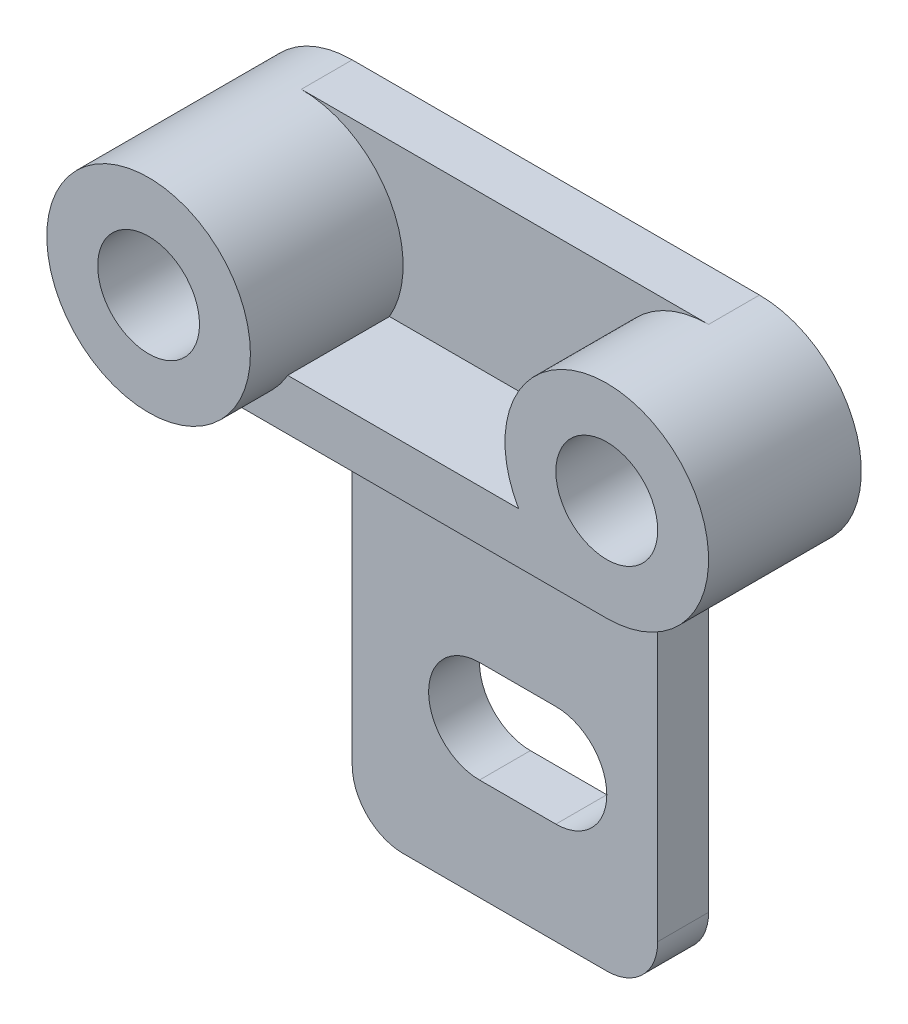
ISO-10303-21;
HEADER;
FILE_DESCRIPTION(('STEP AP214'),'2;1');
FILE_NAME('part.step','',(''),(''),'','','');
FILE_SCHEMA(('AUTOMOTIVE_DESIGN { 1 0 10303 214 1 1 1 1 }'));
ENDSEC;
DATA;
#1=APPLICATION_CONTEXT('core data for automotive mechanical design processes');
#2=APPLICATION_PROTOCOL_DEFINITION('international standard','automotive_design',2000,#1);
#3=PRODUCT_CONTEXT('',#1,'mechanical');
#4=PRODUCT('Part','Part','',(#3));
#5=PRODUCT_RELATED_PRODUCT_CATEGORY('part','',(#4));
#6=PRODUCT_DEFINITION_FORMATION('','',#4);
#7=PRODUCT_DEFINITION_CONTEXT('part definition',#1,'design');
#8=PRODUCT_DEFINITION('design','',#6,#7);
#9=PRODUCT_DEFINITION_SHAPE('','',#8);
#10=(LENGTH_UNIT() NAMED_UNIT(*) SI_UNIT(.MILLI.,.METRE.));
#11=(NAMED_UNIT(*) PLANE_ANGLE_UNIT() SI_UNIT($,.RADIAN.));
#12=(NAMED_UNIT(*) SI_UNIT($,.STERADIAN.) SOLID_ANGLE_UNIT());
#13=UNCERTAINTY_MEASURE_WITH_UNIT(LENGTH_MEASURE(1.E-05),#10,'distance_accuracy_value','');
#14=(GEOMETRIC_REPRESENTATION_CONTEXT(3) GLOBAL_UNCERTAINTY_ASSIGNED_CONTEXT((#13)) GLOBAL_UNIT_ASSIGNED_CONTEXT((#10,
#11,#12)) REPRESENTATION_CONTEXT('',''));
#15=CARTESIAN_POINT('',(0.,0.,0.));
#16=DIRECTION('',(0.,0.,1.));
#17=DIRECTION('',(1.,0.,0.));
#18=AXIS2_PLACEMENT_3D('',#15,#16,#17);
#19=CARTESIAN_POINT('',(30.,0.,10.));
#20=DIRECTION('',(1.,0.,0.));
#21=DIRECTION('',(0.,1.,0.));
#22=AXIS2_PLACEMENT_3D('',#19,#20,#21);
#23=PLANE('',#22);
#24=DIRECTION('',(0.,-1.,0.));
#25=VECTOR('',#24,1.);
#26=CARTESIAN_POINT('',(30.,0.,0.));
#27=LINE('',#26,#25);
#28=CARTESIAN_POINT('',(30.,0.,0.));
#29=VERTEX_POINT('',#28);
#30=CARTESIAN_POINT('',(30.,-69.9999999999999,0.));
#31=VERTEX_POINT('',#30);
#32=EDGE_CURVE('E206',#29,#31,#27,.T.);
#33=ORIENTED_EDGE('',*,*,#32,.T.);
#34=DIRECTION('',(0.,0.,-1.));
#35=VECTOR('',#34,1.);
#36=CARTESIAN_POINT('',(30.,-69.9999999999999,10.));
#37=LINE('',#36,#35);
#38=CARTESIAN_POINT('',(30.,-69.9999999999999,10.));
#39=VERTEX_POINT('',#38);
#40=EDGE_CURVE('E13',#39,#31,#37,.T.);
#41=ORIENTED_EDGE('',*,*,#40,.F.);
#42=DIRECTION('',(0.,-1.,0.));
#43=VECTOR('',#42,1.);
#44=CARTESIAN_POINT('',(30.,0.,10.));
#45=LINE('',#44,#43);
#46=CARTESIAN_POINT('',(30.,0.,10.));
#47=VERTEX_POINT('',#46);
#48=EDGE_CURVE('E263',#47,#39,#45,.T.);
#49=ORIENTED_EDGE('',*,*,#48,.F.);
#50=DIRECTION('',(0.,0.,-1.));
#51=VECTOR('',#50,1.);
#52=CARTESIAN_POINT('',(30.,0.,10.));
#53=LINE('',#52,#51);
#54=EDGE_CURVE('E223',#47,#29,#53,.T.);
#55=ORIENTED_EDGE('',*,*,#54,.T.);
#56=EDGE_LOOP('',(#33,#41,#49,#55));
#57=FACE_BOUND('',#56,.T.);
#58=ADVANCED_FACE('F73',(#57),#23,.F.);
#59=CARTESIAN_POINT('',(40.,-70.,10.));
#60=DIRECTION('',(0.,0.,-1.));
#61=DIRECTION('',(-1.,0.,0.));
#62=AXIS2_PLACEMENT_3D('',#59,#60,#61);
#63=CYLINDRICAL_SURFACE('',#62,9.99999999999999);
#64=CARTESIAN_POINT('',(40.,-70.,0.));
#65=DIRECTION('',(0.,0.,1.));
#66=DIRECTION('',(1.,0.,0.));
#67=AXIS2_PLACEMENT_3D('',#64,#65,#66);
#68=CIRCLE('',#67,9.99999999999999);
#69=CARTESIAN_POINT('',(40.0000000000001,-80.,0.));
#70=VERTEX_POINT('',#69);
#71=EDGE_CURVE('E210',#31,#70,#68,.T.);
#72=ORIENTED_EDGE('',*,*,#71,.T.);
#73=DIRECTION('',(0.,0.,-1.));
#74=VECTOR('',#73,1.);
#75=CARTESIAN_POINT('',(40.0000000000001,-80.,10.));
#76=LINE('',#75,#74);
#77=CARTESIAN_POINT('',(40.0000000000001,-80.,10.));
#78=VERTEX_POINT('',#77);
#79=EDGE_CURVE('E84',#78,#70,#76,.T.);
#80=ORIENTED_EDGE('',*,*,#79,.F.);
#81=CARTESIAN_POINT('',(40.,-70.,10.));
#82=DIRECTION('',(0.,0.,1.));
#83=DIRECTION('',(1.,0.,0.));
#84=AXIS2_PLACEMENT_3D('',#81,#82,#83);
#85=CIRCLE('',#84,9.99999999999999);
#86=EDGE_CURVE('E273',#39,#78,#85,.T.);
#87=ORIENTED_EDGE('',*,*,#86,.F.);
#88=ORIENTED_EDGE('',*,*,#40,.T.);
#89=EDGE_LOOP('',(#72,#80,#87,#88));
#90=FACE_BOUND('',#89,.T.);
#91=ADVANCED_FACE('F280',(#90),#63,.T.);
#92=CARTESIAN_POINT('',(0.,-80.,10.));
#93=DIRECTION('',(0.,1.,0.));
#94=DIRECTION('',(0.,0.,1.));
#95=AXIS2_PLACEMENT_3D('',#92,#93,#94);
#96=PLANE('',#95);
#97=DIRECTION('',(1.,0.,0.));
#98=VECTOR('',#97,1.);
#99=CARTESIAN_POINT('',(0.,-80.,0.));
#100=LINE('',#99,#98);
#101=CARTESIAN_POINT('',(79.9999999999999,-80.,0.));
#102=VERTEX_POINT('',#101);
#103=EDGE_CURVE('E213',#70,#102,#100,.T.);
#104=ORIENTED_EDGE('',*,*,#103,.T.);
#105=DIRECTION('',(0.,0.,-1.));
#106=VECTOR('',#105,1.);
#107=CARTESIAN_POINT('',(79.9999999999999,-80.,10.));
#108=LINE('',#107,#106);
#109=CARTESIAN_POINT('',(79.9999999999999,-80.,10.));
#110=VERTEX_POINT('',#109);
#111=EDGE_CURVE('E179',#110,#102,#108,.T.);
#112=ORIENTED_EDGE('',*,*,#111,.F.);
#113=DIRECTION('',(1.,0.,0.));
#114=VECTOR('',#113,1.);
#115=CARTESIAN_POINT('',(0.,-80.,10.));
#116=LINE('',#115,#114);
#117=EDGE_CURVE('E168',#78,#110,#116,.T.);
#118=ORIENTED_EDGE('',*,*,#117,.F.);
#119=ORIENTED_EDGE('',*,*,#79,.T.);
#120=EDGE_LOOP('',(#104,#112,#118,#119));
#121=FACE_BOUND('',#120,.T.);
#122=ADVANCED_FACE('F283',(#121),#96,.F.);
#123=CARTESIAN_POINT('',(80.,-70.,10.));
#124=DIRECTION('',(0.,0.,-1.));
#125=DIRECTION('',(-1.,0.,0.));
#126=AXIS2_PLACEMENT_3D('',#123,#124,#125);
#127=CYLINDRICAL_SURFACE('',#126,9.99999999999999);
#128=CARTESIAN_POINT('',(80.,-70.,0.));
#129=DIRECTION('',(0.,0.,1.));
#130=DIRECTION('',(1.,0.,0.));
#131=AXIS2_PLACEMENT_3D('',#128,#129,#130);
#132=CIRCLE('',#131,9.99999999999999);
#133=CARTESIAN_POINT('',(90.,-69.9999999999999,0.));
#134=VERTEX_POINT('',#133);
#135=EDGE_CURVE('E177',#102,#134,#132,.T.);
#136=ORIENTED_EDGE('',*,*,#135,.T.);
#137=DIRECTION('',(0.,0.,-1.));
#138=VECTOR('',#137,1.);
#139=CARTESIAN_POINT('',(90.,-69.9999999999999,10.));
#140=LINE('',#139,#138);
#141=CARTESIAN_POINT('',(90.,-69.9999999999999,10.));
#142=VERTEX_POINT('',#141);
#143=EDGE_CURVE('E174',#142,#134,#140,.T.);
#144=ORIENTED_EDGE('',*,*,#143,.F.);
#145=CARTESIAN_POINT('',(80.,-70.,10.));
#146=DIRECTION('',(0.,0.,1.));
#147=DIRECTION('',(1.,0.,0.));
#148=AXIS2_PLACEMENT_3D('',#145,#146,#147);
#149=CIRCLE('',#148,9.99999999999999);
#150=EDGE_CURVE('E162',#110,#142,#149,.T.);
#151=ORIENTED_EDGE('',*,*,#150,.F.);
#152=ORIENTED_EDGE('',*,*,#111,.T.);
#153=EDGE_LOOP('',(#136,#144,#151,#152));
#154=FACE_BOUND('',#153,.T.);
#155=ADVANCED_FACE('F175',(#154),#127,.T.);
#156=CARTESIAN_POINT('',(90.,0.,10.));
#157=DIRECTION('',(-1.,0.,0.));
#158=DIRECTION('',(0.,0.,1.));
#159=AXIS2_PLACEMENT_3D('',#156,#157,#158);
#160=PLANE('',#159);
#161=DIRECTION('',(0.,1.,0.));
#162=VECTOR('',#161,1.);
#163=CARTESIAN_POINT('',(90.,0.,0.));
#164=LINE('',#163,#162);
#165=CARTESIAN_POINT('',(90.,0.,0.));
#166=VERTEX_POINT('',#165);
#167=EDGE_CURVE('E128',#134,#166,#164,.T.);
#168=ORIENTED_EDGE('',*,*,#167,.T.);
#169=DIRECTION('',(0.,0.,-1.));
#170=VECTOR('',#169,1.);
#171=CARTESIAN_POINT('',(90.,0.,10.));
#172=LINE('',#171,#170);
#173=CARTESIAN_POINT('',(90.,0.,10.));
#174=VERTEX_POINT('',#173);
#175=EDGE_CURVE('E180',#174,#166,#172,.T.);
#176=ORIENTED_EDGE('',*,*,#175,.F.);
#177=DIRECTION('',(0.,1.,0.));
#178=VECTOR('',#177,1.);
#179=CARTESIAN_POINT('',(90.,0.,10.));
#180=LINE('',#179,#178);
#181=EDGE_CURVE('E166',#142,#174,#180,.T.);
#182=ORIENTED_EDGE('',*,*,#181,.F.);
#183=ORIENTED_EDGE('',*,*,#143,.T.);
#184=EDGE_LOOP('',(#168,#176,#182,#183));
#185=FACE_BOUND('',#184,.T.);
#186=ADVANCED_FACE('F182',(#185),#160,.F.);
#187=CARTESIAN_POINT('',(70.,-50.,10.));
#188=DIRECTION('',(0.,0.,-1.));
#189=DIRECTION('',(-1.,0.,0.));
#190=AXIS2_PLACEMENT_3D('',#187,#188,#189);
#191=CYLINDRICAL_SURFACE('',#190,10.);
#192=CARTESIAN_POINT('',(70.,-50.,0.));
#193=DIRECTION('',(0.,0.,1.));
#194=DIRECTION('',(1.,0.,0.));
#195=AXIS2_PLACEMENT_3D('',#192,#193,#194);
#196=CIRCLE('',#195,10.);
#197=CARTESIAN_POINT('',(70.,-60.,0.));
#198=VERTEX_POINT('',#197);
#199=CARTESIAN_POINT('',(70.,-40.,0.));
#200=VERTEX_POINT('',#199);
#201=EDGE_CURVE('E190',#198,#200,#196,.T.);
#202=ORIENTED_EDGE('',*,*,#201,.F.);
#203=DIRECTION('',(0.,0.,-1.));
#204=VECTOR('',#203,1.);
#205=CARTESIAN_POINT('',(70.,-60.,10.));
#206=LINE('',#205,#204);
#207=CARTESIAN_POINT('',(70.,-60.,10.));
#208=VERTEX_POINT('',#207);
#209=EDGE_CURVE('E77',#208,#198,#206,.T.);
#210=ORIENTED_EDGE('',*,*,#209,.F.);
#211=CARTESIAN_POINT('',(70.,-50.,10.));
#212=DIRECTION('',(0.,0.,1.));
#213=DIRECTION('',(1.,0.,0.));
#214=AXIS2_PLACEMENT_3D('',#211,#212,#213);
#215=CIRCLE('',#214,10.);
#216=CARTESIAN_POINT('',(70.,-40.,10.));
#217=VERTEX_POINT('',#216);
#218=EDGE_CURVE('E222',#208,#217,#215,.T.);
#219=ORIENTED_EDGE('',*,*,#218,.T.);
#220=DIRECTION('',(0.,0.,-1.));
#221=VECTOR('',#220,1.);
#222=CARTESIAN_POINT('',(70.,-40.,10.));
#223=LINE('',#222,#221);
#224=EDGE_CURVE('E186',#217,#200,#223,.T.);
#225=ORIENTED_EDGE('',*,*,#224,.T.);
#226=EDGE_LOOP('',(#202,#210,#219,#225));
#227=FACE_BOUND('',#226,.T.);
#228=ADVANCED_FACE('F75',(#227),#191,.F.);
#229=CARTESIAN_POINT('',(0.,-60.,10.));
#230=DIRECTION('',(0.,1.,0.));
#231=DIRECTION('',(0.,0.,1.));
#232=AXIS2_PLACEMENT_3D('',#229,#230,#231);
#233=PLANE('',#232);
#234=DIRECTION('',(1.,0.,0.));
#235=VECTOR('',#234,1.);
#236=CARTESIAN_POINT('',(0.,-60.,0.));
#237=LINE('',#236,#235);
#238=CARTESIAN_POINT('',(55.,-60.,0.));
#239=VERTEX_POINT('',#238);
#240=EDGE_CURVE('E194',#239,#198,#237,.T.);
#241=ORIENTED_EDGE('',*,*,#240,.F.);
#242=DIRECTION('',(0.,0.,-1.));
#243=VECTOR('',#242,1.);
#244=CARTESIAN_POINT('',(55.,-60.,10.));
#245=LINE('',#244,#243);
#246=CARTESIAN_POINT('',(55.,-60.,10.));
#247=VERTEX_POINT('',#246);
#248=EDGE_CURVE('E237',#247,#239,#245,.T.);
#249=ORIENTED_EDGE('',*,*,#248,.F.);
#250=DIRECTION('',(1.,0.,0.));
#251=VECTOR('',#250,1.);
#252=CARTESIAN_POINT('',(0.,-60.,10.));
#253=LINE('',#252,#251);
#254=EDGE_CURVE('E248',#247,#208,#253,.T.);
#255=ORIENTED_EDGE('',*,*,#254,.T.);
#256=ORIENTED_EDGE('',*,*,#209,.T.);
#257=EDGE_LOOP('',(#241,#249,#255,#256));
#258=FACE_BOUND('',#257,.T.);
#259=ADVANCED_FACE('F246',(#258),#233,.T.);
#260=CARTESIAN_POINT('',(55.,-50.,10.));
#261=DIRECTION('',(0.,0.,-1.));
#262=DIRECTION('',(-1.,0.,0.));
#263=AXIS2_PLACEMENT_3D('',#260,#261,#262);
#264=CYLINDRICAL_SURFACE('',#263,10.);
#265=CARTESIAN_POINT('',(55.,-50.,0.));
#266=DIRECTION('',(0.,0.,1.));
#267=DIRECTION('',(1.,0.,0.));
#268=AXIS2_PLACEMENT_3D('',#265,#266,#267);
#269=CIRCLE('',#268,10.);
#270=CARTESIAN_POINT('',(55.,-40.,0.));
#271=VERTEX_POINT('',#270);
#272=EDGE_CURVE('E198',#271,#239,#269,.T.);
#273=ORIENTED_EDGE('',*,*,#272,.F.);
#274=DIRECTION('',(0.,0.,-1.));
#275=VECTOR('',#274,1.);
#276=CARTESIAN_POINT('',(55.,-40.,10.));
#277=LINE('',#276,#275);
#278=CARTESIAN_POINT('',(55.,-40.,10.));
#279=VERTEX_POINT('',#278);
#280=EDGE_CURVE('E235',#279,#271,#277,.T.);
#281=ORIENTED_EDGE('',*,*,#280,.F.);
#282=CARTESIAN_POINT('',(55.,-50.,10.));
#283=DIRECTION('',(0.,0.,1.));
#284=DIRECTION('',(1.,0.,0.));
#285=AXIS2_PLACEMENT_3D('',#282,#283,#284);
#286=CIRCLE('',#285,10.);
#287=EDGE_CURVE('E257',#279,#247,#286,.T.);
#288=ORIENTED_EDGE('',*,*,#287,.T.);
#289=ORIENTED_EDGE('',*,*,#248,.T.);
#290=EDGE_LOOP('',(#273,#281,#288,#289));
#291=FACE_BOUND('',#290,.T.);
#292=ADVANCED_FACE('F254',(#291),#264,.F.);
#293=CARTESIAN_POINT('',(0.,-40.,10.));
#294=DIRECTION('',(0.,1.,0.));
#295=DIRECTION('',(0.,0.,1.));
#296=AXIS2_PLACEMENT_3D('',#293,#294,#295);
#297=PLANE('',#296);
#298=DIRECTION('',(1.,0.,0.));
#299=VECTOR('',#298,1.);
#300=CARTESIAN_POINT('',(0.,-40.,0.));
#301=LINE('',#300,#299);
#302=EDGE_CURVE('E202',#271,#200,#301,.T.);
#303=ORIENTED_EDGE('',*,*,#302,.T.);
#304=ORIENTED_EDGE('',*,*,#224,.F.);
#305=DIRECTION('',(1.,0.,0.));
#306=VECTOR('',#305,1.);
#307=CARTESIAN_POINT('',(0.,-40.,10.));
#308=LINE('',#307,#306);
#309=EDGE_CURVE('E259',#279,#217,#308,.T.);
#310=ORIENTED_EDGE('',*,*,#309,.F.);
#311=ORIENTED_EDGE('',*,*,#280,.T.);
#312=EDGE_LOOP('',(#303,#304,#310,#311));
#313=FACE_BOUND('',#312,.T.);
#314=ADVANCED_FACE('F260',(#313),#297,.F.);
#315=CARTESIAN_POINT('',(0.,0.,10.));
#316=DIRECTION('',(0.,-1.,0.));
#317=DIRECTION('',(1.,0.,0.));
#318=AXIS2_PLACEMENT_3D('',#315,#316,#317);
#319=PLANE('',#318);
#320=DIRECTION('',(-1.,0.,0.));
#321=VECTOR('',#320,1.);
#322=CARTESIAN_POINT('',(0.,0.,0.));
#323=LINE('',#322,#321);
#324=EDGE_CURVE('E134',#166,#29,#323,.T.);
#325=ORIENTED_EDGE('',*,*,#324,.T.);
#326=ORIENTED_EDGE('',*,*,#54,.F.);
#327=DIRECTION('',(-1.,0.,0.));
#328=VECTOR('',#327,1.);
#329=CARTESIAN_POINT('',(0.,0.,10.));
#330=LINE('',#329,#328);
#331=EDGE_CURVE('E93',#174,#47,#330,.T.);
#332=ORIENTED_EDGE('',*,*,#331,.F.);
#333=ORIENTED_EDGE('',*,*,#175,.T.);
#334=EDGE_LOOP('',(#325,#326,#332,#333));
#335=FACE_BOUND('',#334,.T.);
#336=ADVANCED_FACE('F286',(#335),#319,.F.);
#337=CARTESIAN_POINT('',(0.,0.,10.));
#338=DIRECTION('',(0.,0.,1.));
#339=DIRECTION('',(1.,0.,0.));
#340=AXIS2_PLACEMENT_3D('',#337,#338,#339);
#341=PLANE('',#340);
#342=ORIENTED_EDGE('',*,*,#218,.F.);
#343=ORIENTED_EDGE('',*,*,#254,.F.);
#344=ORIENTED_EDGE('',*,*,#287,.F.);
#345=ORIENTED_EDGE('',*,*,#309,.T.);
#346=EDGE_LOOP('',(#342,#343,#344,#345));
#347=FACE_BOUND('',#346,.T.);
#348=ORIENTED_EDGE('',*,*,#48,.T.);
#349=ORIENTED_EDGE('',*,*,#86,.T.);
#350=ORIENTED_EDGE('',*,*,#117,.T.);
#351=ORIENTED_EDGE('',*,*,#150,.T.);
#352=ORIENTED_EDGE('',*,*,#181,.T.);
#353=ORIENTED_EDGE('',*,*,#331,.T.);
#354=EDGE_LOOP('',(#348,#349,#350,#351,#352,#353));
#355=FACE_BOUND('',#354,.T.);
#356=ADVANCED_FACE('F164',(#347,#355),#341,.T.);
#357=CARTESIAN_POINT('',(0.,0.,0.));
#358=DIRECTION('',(0.,0.,1.));
#359=DIRECTION('',(1.,0.,0.));
#360=AXIS2_PLACEMENT_3D('',#357,#358,#359);
#361=PLANE('',#360);
#362=ORIENTED_EDGE('',*,*,#201,.T.);
#363=ORIENTED_EDGE('',*,*,#302,.F.);
#364=ORIENTED_EDGE('',*,*,#272,.T.);
#365=ORIENTED_EDGE('',*,*,#240,.T.);
#366=EDGE_LOOP('',(#362,#363,#364,#365));
#367=FACE_BOUND('',#366,.T.);
#368=ORIENTED_EDGE('',*,*,#32,.F.);
#369=ORIENTED_EDGE('',*,*,#324,.F.);
#370=ORIENTED_EDGE('',*,*,#167,.F.);
#371=ORIENTED_EDGE('',*,*,#135,.F.);
#372=ORIENTED_EDGE('',*,*,#103,.F.);
#373=ORIENTED_EDGE('',*,*,#71,.F.);
#374=EDGE_LOOP('',(#368,#369,#370,#371,#372,#373));
#375=FACE_BOUND('',#374,.T.);
#376=ADVANCED_FACE('F252',(#367,#375),#361,.F.);
#377=CLOSED_SHELL('',(#58,#91,#122,#155,#186,#228,#259,#292,#314,#336,#356,#376));
#378=MANIFOLD_SOLID_BREP('B2',#377);
#379=CARTESIAN_POINT('',(100.,20.,30.));
#380=DIRECTION('',(0.,0.,-1.));
#381=DIRECTION('',(-1.,0.,0.));
#382=AXIS2_PLACEMENT_3D('',#379,#380,#381);
#383=CYLINDRICAL_SURFACE('',#382,20.);
#384=CARTESIAN_POINT('',(100.,20.,0.));
#385=DIRECTION('',(0.,0.,1.));
#386=DIRECTION('',(1.,0.,0.));
#387=AXIS2_PLACEMENT_3D('',#384,#385,#386);
#388=CIRCLE('',#387,20.);
#389=CARTESIAN_POINT('',(82.6794919243113,9.99999999999999,0.));
#390=VERTEX_POINT('',#389);
#391=CARTESIAN_POINT('',(100.,0.,0.));
#392=VERTEX_POINT('',#391);
#393=EDGE_CURVE('E481',#390,#392,#388,.F.);
#394=ORIENTED_EDGE('',*,*,#393,.F.);
#395=DIRECTION('',(0.,0.,-1.));
#396=VECTOR('',#395,1.);
#397=CARTESIAN_POINT('',(82.6794919243113,9.99999999999999,30.));
#398=LINE('',#397,#396);
#399=CARTESIAN_POINT('',(82.6794919243113,9.99999999999999,30.));
#400=VERTEX_POINT('',#399);
#401=EDGE_CURVE('E71',#400,#390,#398,.T.);
#402=ORIENTED_EDGE('',*,*,#401,.F.);
#403=CARTESIAN_POINT('',(100.,20.,30.));
#404=DIRECTION('',(0.,0.,1.));
#405=DIRECTION('',(1.,0.,0.));
#406=AXIS2_PLACEMENT_3D('',#403,#404,#405);
#407=CIRCLE('',#406,20.);
#408=CARTESIAN_POINT('',(100.,0.,30.));
#409=VERTEX_POINT('',#408);
#410=EDGE_CURVE('E466',#400,#409,#407,.F.);
#411=ORIENTED_EDGE('',*,*,#410,.T.);
#412=DIRECTION('',(0.,0.,-1.));
#413=VECTOR('',#412,1.);
#414=CARTESIAN_POINT('',(100.,0.,30.));
#415=LINE('',#414,#413);
#416=EDGE_CURVE('E434',#409,#392,#415,.T.);
#417=ORIENTED_EDGE('',*,*,#416,.T.);
#418=EDGE_LOOP('',(#394,#402,#411,#417));
#419=FACE_BOUND('',#418,.T.);
#420=ADVANCED_FACE('F418',(#419),#383,.T.);
#421=CARTESIAN_POINT('',(0.,9.99999999999999,30.));
#422=DIRECTION('',(0.,-1.,0.));
#423=DIRECTION('',(0.,0.,-1.));
#424=AXIS2_PLACEMENT_3D('',#421,#422,#423);
#425=PLANE('',#424);
#426=DIRECTION('',(-1.,0.,0.));
#427=VECTOR('',#426,1.);
#428=CARTESIAN_POINT('',(0.,9.99999999999999,0.));
#429=LINE('',#428,#427);
#430=CARTESIAN_POINT('',(37.3205080756888,9.99999999999999,0.));
#431=VERTEX_POINT('',#430);
#432=EDGE_CURVE('E472',#390,#431,#429,.T.);
#433=ORIENTED_EDGE('',*,*,#432,.T.);
#434=DIRECTION('',(0.,0.,-1.));
#435=VECTOR('',#434,1.);
#436=CARTESIAN_POINT('',(37.3205080756888,9.99999999999999,30.));
#437=LINE('',#436,#435);
#438=CARTESIAN_POINT('',(37.3205080756888,9.99999999999999,30.));
#439=VERTEX_POINT('',#438);
#440=EDGE_CURVE('E426',#439,#431,#437,.T.);
#441=ORIENTED_EDGE('',*,*,#440,.F.);
#442=DIRECTION('',(-1.,0.,0.));
#443=VECTOR('',#442,1.);
#444=CARTESIAN_POINT('',(0.,9.99999999999999,30.));
#445=LINE('',#444,#443);
#446=EDGE_CURVE('E460',#400,#439,#445,.T.);
#447=ORIENTED_EDGE('',*,*,#446,.F.);
#448=ORIENTED_EDGE('',*,*,#401,.T.);
#449=EDGE_LOOP('',(#433,#441,#447,#448));
#450=FACE_BOUND('',#449,.T.);
#451=ADVANCED_FACE('F470',(#450),#425,.F.);
#452=CARTESIAN_POINT('',(20.,20.,30.));
#453=DIRECTION('',(0.,0.,-1.));
#454=DIRECTION('',(-1.,0.,0.));
#455=AXIS2_PLACEMENT_3D('',#452,#453,#454);
#456=CYLINDRICAL_SURFACE('',#455,20.);
#457=CARTESIAN_POINT('',(20.,20.,0.));
#458=DIRECTION('',(0.,0.,1.));
#459=DIRECTION('',(1.,0.,0.));
#460=AXIS2_PLACEMENT_3D('',#457,#458,#459);
#461=CIRCLE('',#460,20.);
#462=CARTESIAN_POINT('',(20.,0.,0.));
#463=VERTEX_POINT('',#462);
#464=EDGE_CURVE('E485',#463,#431,#461,.T.);
#465=ORIENTED_EDGE('',*,*,#464,.F.);
#466=DIRECTION('',(0.,0.,-1.));
#467=VECTOR('',#466,1.);
#468=CARTESIAN_POINT('',(20.,0.,30.));
#469=LINE('',#468,#467);
#470=CARTESIAN_POINT('',(20.,0.,30.));
#471=VERTEX_POINT('',#470);
#472=EDGE_CURVE('E447',#471,#463,#469,.T.);
#473=ORIENTED_EDGE('',*,*,#472,.F.);
#474=CARTESIAN_POINT('',(20.,20.,30.));
#475=DIRECTION('',(0.,0.,1.));
#476=DIRECTION('',(1.,0.,0.));
#477=AXIS2_PLACEMENT_3D('',#474,#475,#476);
#478=CIRCLE('',#477,20.);
#479=EDGE_CURVE('E465',#471,#439,#478,.T.);
#480=ORIENTED_EDGE('',*,*,#479,.T.);
#481=ORIENTED_EDGE('',*,*,#440,.T.);
#482=EDGE_LOOP('',(#465,#473,#480,#481));
#483=FACE_BOUND('',#482,.T.);
#484=ADVANCED_FACE('F475',(#483),#456,.F.);
#485=CARTESIAN_POINT('',(0.,0.,30.));
#486=DIRECTION('',(0.,-1.,0.));
#487=DIRECTION('',(1.,0.,0.));
#488=AXIS2_PLACEMENT_3D('',#485,#486,#487);
#489=PLANE('',#488);
#490=DIRECTION('',(-1.,0.,0.));
#491=VECTOR('',#490,1.);
#492=CARTESIAN_POINT('',(0.,0.,0.));
#493=LINE('',#492,#491);
#494=EDGE_CURVE('E487',#392,#463,#493,.T.);
#495=ORIENTED_EDGE('',*,*,#494,.F.);
#496=ORIENTED_EDGE('',*,*,#416,.F.);
#497=DIRECTION('',(-1.,0.,0.));
#498=VECTOR('',#497,1.);
#499=CARTESIAN_POINT('',(0.,0.,30.));
#500=LINE('',#499,#498);
#501=EDGE_CURVE('E476',#409,#471,#500,.T.);
#502=ORIENTED_EDGE('',*,*,#501,.T.);
#503=ORIENTED_EDGE('',*,*,#472,.T.);
#504=EDGE_LOOP('',(#495,#496,#502,#503));
#505=FACE_BOUND('',#504,.T.);
#506=ADVANCED_FACE('F504',(#505),#489,.T.);
#507=CARTESIAN_POINT('',(0.,0.,30.));
#508=DIRECTION('',(0.,0.,1.));
#509=DIRECTION('',(1.,0.,0.));
#510=AXIS2_PLACEMENT_3D('',#507,#508,#509);
#511=PLANE('',#510);
#512=CARTESIAN_POINT('',(100.,20.,30.));
#513=DIRECTION('',(0.,0.,1.));
#514=DIRECTION('',(1.,0.,0.));
#515=AXIS2_PLACEMENT_3D('',#512,#513,#514);
#516=CIRCLE('',#515,9.99999999999999);
#517=CARTESIAN_POINT('',(110.,20.,30.));
#518=VERTEX_POINT('',#517);
#519=EDGE_CURVE('E483',#518,#518,#516,.T.);
#520=ORIENTED_EDGE('',*,*,#519,.F.);
#521=EDGE_LOOP('',(#520));
#522=FACE_BOUND('',#521,.T.);
#523=ORIENTED_EDGE('',*,*,#410,.F.);
#524=ORIENTED_EDGE('',*,*,#446,.T.);
#525=ORIENTED_EDGE('',*,*,#479,.F.);
#526=ORIENTED_EDGE('',*,*,#501,.F.);
#527=EDGE_LOOP('',(#523,#524,#525,#526));
#528=FACE_BOUND('',#527,.T.);
#529=ADVANCED_FACE('F462',(#522,#528),#511,.T.);
#530=CARTESIAN_POINT('',(0.,0.,0.));
#531=DIRECTION('',(0.,0.,1.));
#532=DIRECTION('',(1.,0.,0.));
#533=AXIS2_PLACEMENT_3D('',#530,#531,#532);
#534=PLANE('',#533);
#535=CARTESIAN_POINT('',(100.,20.,0.));
#536=DIRECTION('',(0.,0.,-1.));
#537=DIRECTION('',(-1.,0.,0.));
#538=AXIS2_PLACEMENT_3D('',#535,#536,#537);
#539=CIRCLE('',#538,9.99999999999999);
#540=CARTESIAN_POINT('',(90.,20.,0.));
#541=VERTEX_POINT('',#540);
#542=EDGE_CURVE('E495',#541,#541,#539,.T.);
#543=ORIENTED_EDGE('',*,*,#542,.F.);
#544=EDGE_LOOP('',(#543));
#545=FACE_BOUND('',#544,.T.);
#546=ORIENTED_EDGE('',*,*,#393,.T.);
#547=ORIENTED_EDGE('',*,*,#494,.T.);
#548=ORIENTED_EDGE('',*,*,#464,.T.);
#549=ORIENTED_EDGE('',*,*,#432,.F.);
#550=EDGE_LOOP('',(#546,#547,#548,#549));
#551=FACE_BOUND('',#550,.T.);
#552=ADVANCED_FACE('F501',(#545,#551),#534,.F.);
#553=CARTESIAN_POINT('',(100.,20.,40.));
#554=DIRECTION('',(0.,0.,-1.));
#555=DIRECTION('',(-1.,0.,0.));
#556=AXIS2_PLACEMENT_3D('',#553,#554,#555);
#557=CYLINDRICAL_SURFACE('',#556,9.99999999999999);
#558=ORIENTED_EDGE('',*,*,#519,.T.);
#559=EDGE_LOOP('',(#558));
#560=FACE_BOUND('',#559,.T.);
#561=ORIENTED_EDGE('',*,*,#542,.T.);
#562=EDGE_LOOP('',(#561));
#563=FACE_BOUND('',#562,.T.);
#564=ADVANCED_FACE('F499',(#560,#563),#557,.F.);
#565=CLOSED_SHELL('',(#420,#451,#484,#506,#529,#552,#564));
#566=MANIFOLD_SOLID_BREP('B7',#565);
#567=CARTESIAN_POINT('',(100.,20.,10.));
#568=DIRECTION('',(0.,0.,-1.));
#569=DIRECTION('',(-1.,0.,0.));
#570=AXIS2_PLACEMENT_3D('',#567,#568,#569);
#571=CYLINDRICAL_SURFACE('',#570,20.);
#572=CARTESIAN_POINT('',(100.,20.,0.));
#573=DIRECTION('',(0.,0.,1.));
#574=DIRECTION('',(1.,0.,0.));
#575=AXIS2_PLACEMENT_3D('',#572,#573,#574);
#576=CIRCLE('',#575,20.);
#577=CARTESIAN_POINT('',(100.,40.,0.));
#578=VERTEX_POINT('',#577);
#579=CARTESIAN_POINT('',(100.,0.,0.));
#580=VERTEX_POINT('',#579);
#581=EDGE_CURVE('E632',#578,#580,#576,.F.);
#582=ORIENTED_EDGE('',*,*,#581,.F.);
#583=DIRECTION('',(0.,0.,-1.));
#584=VECTOR('',#583,1.);
#585=CARTESIAN_POINT('',(100.,40.,10.));
#586=LINE('',#585,#584);
#587=CARTESIAN_POINT('',(100.,40.,10.));
#588=VERTEX_POINT('',#587);
#589=EDGE_CURVE('E416',#588,#578,#586,.T.);
#590=ORIENTED_EDGE('',*,*,#589,.F.);
#591=CARTESIAN_POINT('',(100.,20.,10.));
#592=DIRECTION('',(0.,0.,1.));
#593=DIRECTION('',(1.,0.,0.));
#594=AXIS2_PLACEMENT_3D('',#591,#592,#593);
#595=CIRCLE('',#594,20.);
#596=CARTESIAN_POINT('',(100.,0.,10.));
#597=VERTEX_POINT('',#596);
#598=EDGE_CURVE('E644',#588,#597,#595,.F.);
#599=ORIENTED_EDGE('',*,*,#598,.T.);
#600=DIRECTION('',(0.,0.,-1.));
#601=VECTOR('',#600,1.);
#602=CARTESIAN_POINT('',(100.,0.,10.));
#603=LINE('',#602,#601);
#604=EDGE_CURVE('E599',#597,#580,#603,.T.);
#605=ORIENTED_EDGE('',*,*,#604,.T.);
#606=EDGE_LOOP('',(#582,#590,#599,#605));
#607=FACE_BOUND('',#606,.T.);
#608=ADVANCED_FACE('F583',(#607),#571,.T.);
#609=CARTESIAN_POINT('',(0.,40.,10.));
#610=DIRECTION('',(0.,1.,0.));
#611=DIRECTION('',(0.,0.,1.));
#612=AXIS2_PLACEMENT_3D('',#609,#610,#611);
#613=PLANE('',#612);
#614=DIRECTION('',(1.,0.,0.));
#615=VECTOR('',#614,1.);
#616=CARTESIAN_POINT('',(0.,40.,0.));
#617=LINE('',#616,#615);
#618=CARTESIAN_POINT('',(20.,40.,0.));
#619=VERTEX_POINT('',#618);
#620=EDGE_CURVE('E641',#619,#578,#617,.T.);
#621=ORIENTED_EDGE('',*,*,#620,.F.);
#622=DIRECTION('',(0.,0.,-1.));
#623=VECTOR('',#622,1.);
#624=CARTESIAN_POINT('',(20.,40.,10.));
#625=LINE('',#624,#623);
#626=CARTESIAN_POINT('',(20.,40.,10.));
#627=VERTEX_POINT('',#626);
#628=EDGE_CURVE('E591',#627,#619,#625,.T.);
#629=ORIENTED_EDGE('',*,*,#628,.F.);
#630=DIRECTION('',(1.,0.,0.));
#631=VECTOR('',#630,1.);
#632=CARTESIAN_POINT('',(0.,40.,10.));
#633=LINE('',#632,#631);
#634=EDGE_CURVE('E639',#627,#588,#633,.T.);
#635=ORIENTED_EDGE('',*,*,#634,.T.);
#636=ORIENTED_EDGE('',*,*,#589,.T.);
#637=EDGE_LOOP('',(#621,#629,#635,#636));
#638=FACE_BOUND('',#637,.T.);
#639=ADVANCED_FACE('F638',(#638),#613,.T.);
#640=CARTESIAN_POINT('',(20.,20.,10.));
#641=DIRECTION('',(0.,0.,-1.));
#642=DIRECTION('',(-1.,0.,0.));
#643=AXIS2_PLACEMENT_3D('',#640,#641,#642);
#644=CYLINDRICAL_SURFACE('',#643,20.);
#645=CARTESIAN_POINT('',(20.,20.,0.));
#646=DIRECTION('',(0.,0.,1.));
#647=DIRECTION('',(1.,0.,0.));
#648=AXIS2_PLACEMENT_3D('',#645,#646,#647);
#649=CIRCLE('',#648,20.);
#650=CARTESIAN_POINT('',(20.,0.,0.));
#651=VERTEX_POINT('',#650);
#652=EDGE_CURVE('E656',#619,#651,#649,.T.);
#653=ORIENTED_EDGE('',*,*,#652,.T.);
#654=DIRECTION('',(0.,0.,-1.));
#655=VECTOR('',#654,1.);
#656=CARTESIAN_POINT('',(20.,0.,10.));
#657=LINE('',#656,#655);
#658=CARTESIAN_POINT('',(20.,0.,10.));
#659=VERTEX_POINT('',#658);
#660=EDGE_CURVE('E614',#659,#651,#657,.T.);
#661=ORIENTED_EDGE('',*,*,#660,.F.);
#662=CARTESIAN_POINT('',(20.,20.,10.));
#663=DIRECTION('',(0.,0.,1.));
#664=DIRECTION('',(1.,0.,0.));
#665=AXIS2_PLACEMENT_3D('',#662,#663,#664);
#666=CIRCLE('',#665,20.);
#667=EDGE_CURVE('E624',#627,#659,#666,.F.);
#668=ORIENTED_EDGE('',*,*,#667,.F.);
#669=ORIENTED_EDGE('',*,*,#628,.T.);
#670=EDGE_LOOP('',(#653,#661,#668,#669));
#671=FACE_BOUND('',#670,.T.);
#672=CARTESIAN_POINT('',(20.,20.,40.));
#673=DIRECTION('',(0.,0.,1.));
#674=DIRECTION('',(1.,0.,0.));
#675=AXIS2_PLACEMENT_3D('',#672,#673,#674);
#676=CIRCLE('',#675,20.);
#677=CARTESIAN_POINT('',(40.,20.,40.));
#678=VERTEX_POINT('',#677);
#679=EDGE_CURVE('E633',#678,#678,#676,.T.);
#680=ORIENTED_EDGE('',*,*,#679,.F.);
#681=EDGE_LOOP('',(#680));
#682=FACE_BOUND('',#681,.T.);
#683=ADVANCED_FACE('F626',(#671,#682),#644,.T.);
#684=CARTESIAN_POINT('',(0.,0.,10.));
#685=DIRECTION('',(0.,-1.,0.));
#686=DIRECTION('',(1.,0.,0.));
#687=AXIS2_PLACEMENT_3D('',#684,#685,#686);
#688=PLANE('',#687);
#689=DIRECTION('',(-1.,0.,0.));
#690=VECTOR('',#689,1.);
#691=CARTESIAN_POINT('',(0.,0.,0.));
#692=LINE('',#691,#690);
#693=EDGE_CURVE('E658',#580,#651,#692,.T.);
#694=ORIENTED_EDGE('',*,*,#693,.F.);
#695=ORIENTED_EDGE('',*,*,#604,.F.);
#696=DIRECTION('',(-1.,0.,0.));
#697=VECTOR('',#696,1.);
#698=CARTESIAN_POINT('',(0.,0.,10.));
#699=LINE('',#698,#697);
#700=EDGE_CURVE('E645',#597,#659,#699,.T.);
#701=ORIENTED_EDGE('',*,*,#700,.T.);
#702=ORIENTED_EDGE('',*,*,#660,.T.);
#703=EDGE_LOOP('',(#694,#695,#701,#702));
#704=FACE_BOUND('',#703,.T.);
#705=ADVANCED_FACE('F688',(#704),#688,.T.);
#706=CARTESIAN_POINT('',(100.,20.,10.));
#707=DIRECTION('',(0.,0.,-1.));
#708=DIRECTION('',(-1.,0.,0.));
#709=AXIS2_PLACEMENT_3D('',#706,#707,#708);
#710=CYLINDRICAL_SURFACE('',#709,9.99999999999999);
#711=CARTESIAN_POINT('',(100.,20.,10.));
#712=DIRECTION('',(0.,0.,1.));
#713=DIRECTION('',(1.,0.,0.));
#714=AXIS2_PLACEMENT_3D('',#711,#712,#713);
#715=CIRCLE('',#714,9.99999999999999);
#716=CARTESIAN_POINT('',(110.,20.,10.));
#717=VERTEX_POINT('',#716);
#718=EDGE_CURVE('E647',#717,#717,#715,.F.);
#719=ORIENTED_EDGE('',*,*,#718,.F.);
#720=EDGE_LOOP('',(#719));
#721=FACE_BOUND('',#720,.T.);
#722=CARTESIAN_POINT('',(100.,20.,0.));
#723=DIRECTION('',(0.,0.,1.));
#724=DIRECTION('',(1.,0.,0.));
#725=AXIS2_PLACEMENT_3D('',#722,#723,#724);
#726=CIRCLE('',#725,9.99999999999999);
#727=CARTESIAN_POINT('',(110.,20.,0.));
#728=VERTEX_POINT('',#727);
#729=EDGE_CURVE('E649',#728,#728,#726,.F.);
#730=ORIENTED_EDGE('',*,*,#729,.T.);
#731=EDGE_LOOP('',(#730));
#732=FACE_BOUND('',#731,.T.);
#733=ADVANCED_FACE('F666',(#721,#732),#710,.F.);
#734=CARTESIAN_POINT('',(0.,0.,10.));
#735=DIRECTION('',(0.,0.,1.));
#736=DIRECTION('',(1.,0.,0.));
#737=AXIS2_PLACEMENT_3D('',#734,#735,#736);
#738=PLANE('',#737);
#739=ORIENTED_EDGE('',*,*,#634,.F.);
#740=ORIENTED_EDGE('',*,*,#667,.T.);
#741=ORIENTED_EDGE('',*,*,#700,.F.);
#742=ORIENTED_EDGE('',*,*,#598,.F.);
#743=EDGE_LOOP('',(#739,#740,#741,#742));
#744=FACE_BOUND('',#743,.T.);
#745=ORIENTED_EDGE('',*,*,#718,.T.);
#746=EDGE_LOOP('',(#745));
#747=FACE_BOUND('',#746,.T.);
#748=ADVANCED_FACE('F642',(#744,#747),#738,.T.);
#749=CARTESIAN_POINT('',(0.,0.,0.));
#750=DIRECTION('',(0.,0.,1.));
#751=DIRECTION('',(1.,0.,0.));
#752=AXIS2_PLACEMENT_3D('',#749,#750,#751);
#753=PLANE('',#752);
#754=CARTESIAN_POINT('',(20.,20.,0.));
#755=DIRECTION('',(0.,0.,1.));
#756=DIRECTION('',(1.,0.,0.));
#757=AXIS2_PLACEMENT_3D('',#754,#755,#756);
#758=CIRCLE('',#757,10.);
#759=CARTESIAN_POINT('',(30.,20.,0.));
#760=VERTEX_POINT('',#759);
#761=EDGE_CURVE('E789',#760,#760,#758,.T.);
#762=ORIENTED_EDGE('',*,*,#761,.T.);
#763=EDGE_LOOP('',(#762));
#764=FACE_BOUND('',#763,.T.);
#765=ORIENTED_EDGE('',*,*,#693,.T.);
#766=ORIENTED_EDGE('',*,*,#652,.F.);
#767=ORIENTED_EDGE('',*,*,#620,.T.);
#768=ORIENTED_EDGE('',*,*,#581,.T.);
#769=EDGE_LOOP('',(#765,#766,#767,#768));
#770=FACE_BOUND('',#769,.T.);
#771=ORIENTED_EDGE('',*,*,#729,.F.);
#772=EDGE_LOOP('',(#771));
#773=FACE_BOUND('',#772,.T.);
#774=ADVANCED_FACE('F668',(#764,#770,#773),#753,.F.);
#775=CARTESIAN_POINT('',(20.,20.,40.));
#776=DIRECTION('',(0.,0.,1.));
#777=DIRECTION('',(1.,0.,0.));
#778=AXIS2_PLACEMENT_3D('',#775,#776,#777);
#779=PLANE('',#778);
#780=CARTESIAN_POINT('',(20.,20.,40.));
#781=DIRECTION('',(0.,0.,1.));
#782=DIRECTION('',(1.,0.,0.));
#783=AXIS2_PLACEMENT_3D('',#780,#781,#782);
#784=CIRCLE('',#783,10.);
#785=CARTESIAN_POINT('',(30.,20.,40.));
#786=VERTEX_POINT('',#785);
#787=EDGE_CURVE('E787',#786,#786,#784,.T.);
#788=ORIENTED_EDGE('',*,*,#787,.F.);
#789=EDGE_LOOP('',(#788));
#790=FACE_BOUND('',#789,.T.);
#791=ORIENTED_EDGE('',*,*,#679,.T.);
#792=EDGE_LOOP('',(#791));
#793=FACE_BOUND('',#792,.T.);
#794=ADVANCED_FACE('F670',(#790,#793),#779,.T.);
#795=CARTESIAN_POINT('',(20.,20.,40.));
#796=DIRECTION('',(0.,0.,-1.));
#797=DIRECTION('',(-1.,0.,0.));
#798=AXIS2_PLACEMENT_3D('',#795,#796,#797);
#799=CYLINDRICAL_SURFACE('',#798,10.);
#800=ORIENTED_EDGE('',*,*,#787,.T.);
#801=EDGE_LOOP('',(#800));
#802=FACE_BOUND('',#801,.T.);
#803=ORIENTED_EDGE('',*,*,#761,.F.);
#804=EDGE_LOOP('',(#803));
#805=FACE_BOUND('',#804,.T.);
#806=ADVANCED_FACE('F677',(#802,#805),#799,.F.);
#807=CLOSED_SHELL('',(#608,#639,#683,#705,#733,#748,#774,#794,#806));
#808=MANIFOLD_SOLID_BREP('B65',#807);
#809=ADVANCED_BREP_SHAPE_REPRESENTATION('',(#18,#378,#566,#808),#14);
#810=SHAPE_DEFINITION_REPRESENTATION(#9,#809);
ENDSEC;
END-ISO-10303-21;
